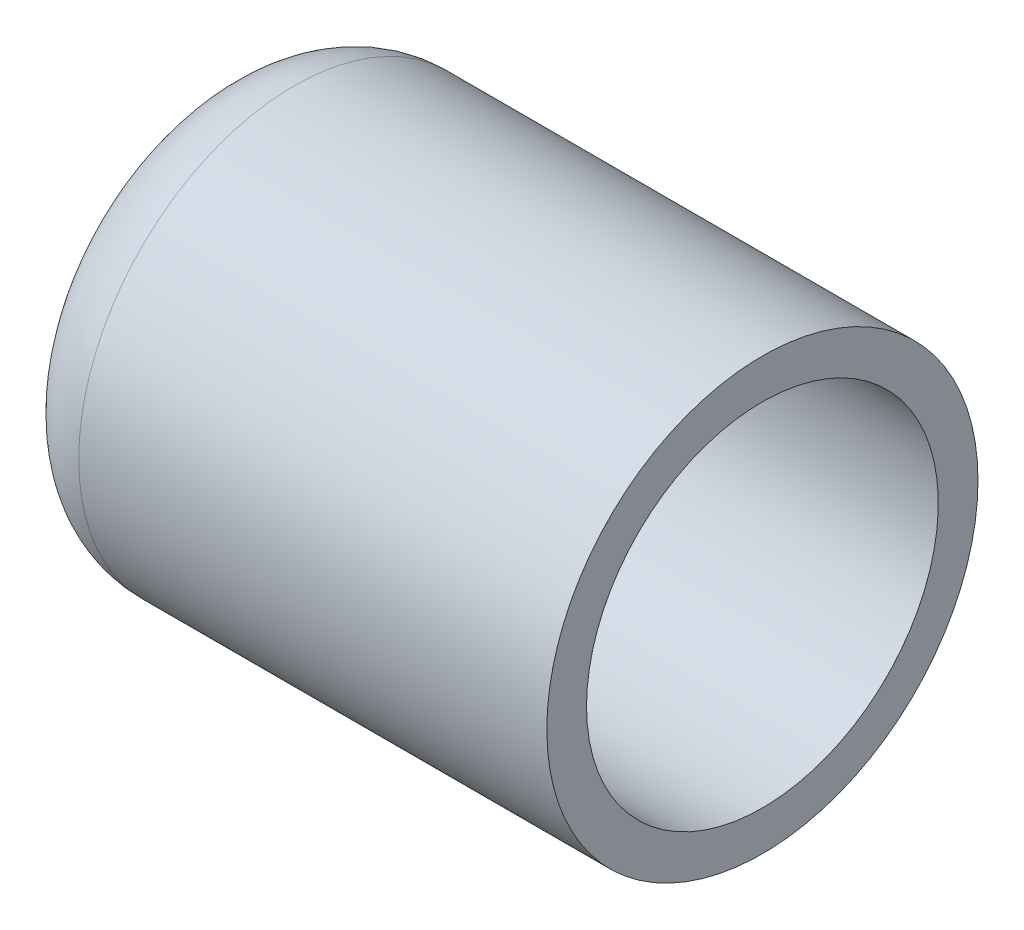
ISO-10303-21;
HEADER;
FILE_DESCRIPTION(('STEP AP214'),'2;1');
FILE_NAME('part.step','',(''),(''),'','','');
FILE_SCHEMA(('AUTOMOTIVE_DESIGN { 1 0 10303 214 1 1 1 1 }'));
ENDSEC;
DATA;
#1=APPLICATION_CONTEXT('core data for automotive mechanical design processes');
#2=APPLICATION_PROTOCOL_DEFINITION('international standard','automotive_design',2000,#1);
#3=PRODUCT_CONTEXT('',#1,'mechanical');
#4=PRODUCT('Part','Part','',(#3));
#5=PRODUCT_RELATED_PRODUCT_CATEGORY('part','',(#4));
#6=PRODUCT_DEFINITION_FORMATION('','',#4);
#7=PRODUCT_DEFINITION_CONTEXT('part definition',#1,'design');
#8=PRODUCT_DEFINITION('design','',#6,#7);
#9=PRODUCT_DEFINITION_SHAPE('','',#8);
#10=(LENGTH_UNIT() NAMED_UNIT(*) SI_UNIT(.MILLI.,.METRE.));
#11=(NAMED_UNIT(*) PLANE_ANGLE_UNIT() SI_UNIT($,.RADIAN.));
#12=(NAMED_UNIT(*) SI_UNIT($,.STERADIAN.) SOLID_ANGLE_UNIT());
#13=UNCERTAINTY_MEASURE_WITH_UNIT(LENGTH_MEASURE(1.E-05),#10,'distance_accuracy_value','');
#14=(GEOMETRIC_REPRESENTATION_CONTEXT(3) GLOBAL_UNCERTAINTY_ASSIGNED_CONTEXT((#13)) GLOBAL_UNIT_ASSIGNED_CONTEXT((#10,
#11,#12)) REPRESENTATION_CONTEXT('',''));
#15=CARTESIAN_POINT('',(0.,0.,0.));
#16=DIRECTION('',(0.,0.,1.));
#17=DIRECTION('',(1.,0.,0.));
#18=AXIS2_PLACEMENT_3D('',#15,#16,#17);
#19=CARTESIAN_POINT('',(-21.0000000000002,0.,0.));
#20=DIRECTION('',(0.,0.,1.));
#21=DIRECTION('',(-1.,0.,0.));
#22=AXIS2_PLACEMENT_3D('',#19,#20,#21);
#23=SPHERICAL_SURFACE('',#22,57.1999999999998);
#24=CARTESIAN_POINT('',(-73.7391289010937,0.,0.));
#25=DIRECTION('',(-1.,0.,0.));
#26=DIRECTION('',(0.,0.,1.));
#27=AXIS2_PLACEMENT_3D('',#24,#25,#26);
#28=CIRCLE('',#27,22.1455251180419);
#29=CARTESIAN_POINT('',(-73.7391289010937,0.,22.1455251180419));
#30=VERTEX_POINT('',#29);
#31=EDGE_CURVE('E17',#30,#30,#28,.T.);
#32=ORIENTED_EDGE('',*,*,#31,.F.);
#33=EDGE_LOOP('',(#32));
#34=FACE_BOUND('',#33,.T.);
#35=ADVANCED_FACE('F13',(#34),#23,.F.);
#36=CARTESIAN_POINT('',(-68.3914549259674,0.,0.));
#37=DIRECTION('',(-1.,0.,0.));
#38=DIRECTION('',(0.,0.,1.));
#39=AXIS2_PLACEMENT_3D('',#36,#37,#38);
#40=TOROIDAL_SURFACE('',#39,19.9,5.79999999999995);
#41=CARTESIAN_POINT('',(-68.3914549259674,0.,0.));
#42=DIRECTION('',(-1.,0.,0.));
#43=DIRECTION('',(0.,1.,0.));
#44=AXIS2_PLACEMENT_3D('',#41,#42,#43);
#45=CIRCLE('',#44,25.7);
#46=CARTESIAN_POINT('',(-68.3914549259674,25.7,0.));
#47=VERTEX_POINT('',#46);
#48=EDGE_CURVE('E34',#47,#47,#45,.T.);
#49=ORIENTED_EDGE('',*,*,#48,.F.);
#50=EDGE_LOOP('',(#49));
#51=FACE_BOUND('',#50,.T.);
#52=ORIENTED_EDGE('',*,*,#31,.T.);
#53=EDGE_LOOP('',(#52));
#54=FACE_BOUND('',#53,.T.);
#55=ADVANCED_FACE('F44',(#51,#54),#40,.F.);
#56=CARTESIAN_POINT('',(0.,0.,0.));
#57=DIRECTION('',(-1.,0.,0.));
#58=DIRECTION('',(0.,0.,1.));
#59=AXIS2_PLACEMENT_3D('',#56,#57,#58);
#60=CYLINDRICAL_SURFACE('',#59,25.7);
#61=CARTESIAN_POINT('',(0.,0.,0.));
#62=DIRECTION('',(-1.,0.,0.));
#63=DIRECTION('',(0.,0.,1.));
#64=AXIS2_PLACEMENT_3D('',#61,#62,#63);
#65=CIRCLE('',#64,25.7);
#66=CARTESIAN_POINT('',(0.,0.,25.7));
#67=VERTEX_POINT('',#66);
#68=EDGE_CURVE('E32',#67,#67,#65,.T.);
#69=ORIENTED_EDGE('',*,*,#68,.F.);
#70=EDGE_LOOP('',(#69));
#71=FACE_BOUND('',#70,.T.);
#72=ORIENTED_EDGE('',*,*,#48,.T.);
#73=EDGE_LOOP('',(#72));
#74=FACE_BOUND('',#73,.T.);
#75=ADVANCED_FACE('F47',(#71,#74),#60,.F.);
#76=CARTESIAN_POINT('',(0.,31.5,31.8780010540613));
#77=DIRECTION('',(1.,0.,0.));
#78=DIRECTION('',(0.,-1.,0.));
#79=AXIS2_PLACEMENT_3D('',#76,#77,#78);
#80=PLANE('',#79);
#81=ORIENTED_EDGE('',*,*,#68,.T.);
#82=EDGE_LOOP('',(#81));
#83=FACE_BOUND('',#82,.T.);
#84=CARTESIAN_POINT('',(0.,0.,0.));
#85=DIRECTION('',(-1.,0.,0.));
#86=DIRECTION('',(0.,0.,1.));
#87=AXIS2_PLACEMENT_3D('',#84,#85,#86);
#88=CIRCLE('',#87,31.5);
#89=CARTESIAN_POINT('',(0.,0.,31.5));
#90=VERTEX_POINT('',#89);
#91=EDGE_CURVE('E26',#90,#90,#88,.T.);
#92=ORIENTED_EDGE('',*,*,#91,.F.);
#93=EDGE_LOOP('',(#92));
#94=FACE_BOUND('',#93,.T.);
#95=ADVANCED_FACE('F51',(#83,#94),#80,.T.);
#96=CARTESIAN_POINT('',(-68.3914549259674,0.,0.));
#97=DIRECTION('',(-1.,0.,0.));
#98=DIRECTION('',(0.,0.,1.));
#99=AXIS2_PLACEMENT_3D('',#96,#97,#98);
#100=CYLINDRICAL_SURFACE('',#99,31.5);
#101=ORIENTED_EDGE('',*,*,#91,.T.);
#102=EDGE_LOOP('',(#101));
#103=FACE_BOUND('',#102,.T.);
#104=CARTESIAN_POINT('',(-68.3914549259674,0.,0.));
#105=DIRECTION('',(-1.,0.,0.));
#106=DIRECTION('',(0.,0.,1.));
#107=AXIS2_PLACEMENT_3D('',#104,#105,#106);
#108=CIRCLE('',#107,31.5);
#109=CARTESIAN_POINT('',(-68.3914549259674,0.,31.5));
#110=VERTEX_POINT('',#109);
#111=EDGE_CURVE('E21',#110,#110,#108,.T.);
#112=ORIENTED_EDGE('',*,*,#111,.F.);
#113=EDGE_LOOP('',(#112));
#114=FACE_BOUND('',#113,.T.);
#115=ADVANCED_FACE('F55',(#103,#114),#100,.T.);
#116=CARTESIAN_POINT('',(-68.3914549259674,0.,0.));
#117=DIRECTION('',(-1.,0.,0.));
#118=DIRECTION('',(0.,0.,1.));
#119=AXIS2_PLACEMENT_3D('',#116,#117,#118);
#120=TOROIDAL_SURFACE('',#119,19.9,11.6);
#121=ORIENTED_EDGE('',*,*,#111,.T.);
#122=EDGE_LOOP('',(#121));
#123=FACE_BOUND('',#122,.T.);
#124=CARTESIAN_POINT('',(-79.0868027302714,0.,0.));
#125=DIRECTION('',(-1.,0.,0.));
#126=DIRECTION('',(0.,0.,1.));
#127=AXIS2_PLACEMENT_3D('',#124,#125,#126);
#128=CIRCLE('',#127,24.3910505836576);
#129=CARTESIAN_POINT('',(-79.0868027302714,0.,24.3910505836576));
#130=VERTEX_POINT('',#129);
#131=EDGE_CURVE('E8',#130,#130,#128,.T.);
#132=ORIENTED_EDGE('',*,*,#131,.F.);
#133=EDGE_LOOP('',(#132));
#134=FACE_BOUND('',#133,.T.);
#135=ADVANCED_FACE('F58',(#123,#134),#120,.T.);
#136=CARTESIAN_POINT('',(-20.9999999999997,0.,0.));
#137=DIRECTION('',(0.,0.,1.));
#138=DIRECTION('',(1.,0.,0.));
#139=AXIS2_PLACEMENT_3D('',#136,#137,#138);
#140=SPHERICAL_SURFACE('',#139,63.0000000000003);
#141=ORIENTED_EDGE('',*,*,#131,.T.);
#142=EDGE_LOOP('',(#141));
#143=FACE_BOUND('',#142,.T.);
#144=ADVANCED_FACE('F62',(#143),#140,.T.);
#145=CLOSED_SHELL('',(#35,#55,#75,#95,#115,#135,#144));
#146=MANIFOLD_SOLID_BREP('B1',#145);
#147=ADVANCED_BREP_SHAPE_REPRESENTATION('',(#18,#146),#14);
#148=SHAPE_DEFINITION_REPRESENTATION(#9,#147);
ENDSEC;
END-ISO-10303-21;
